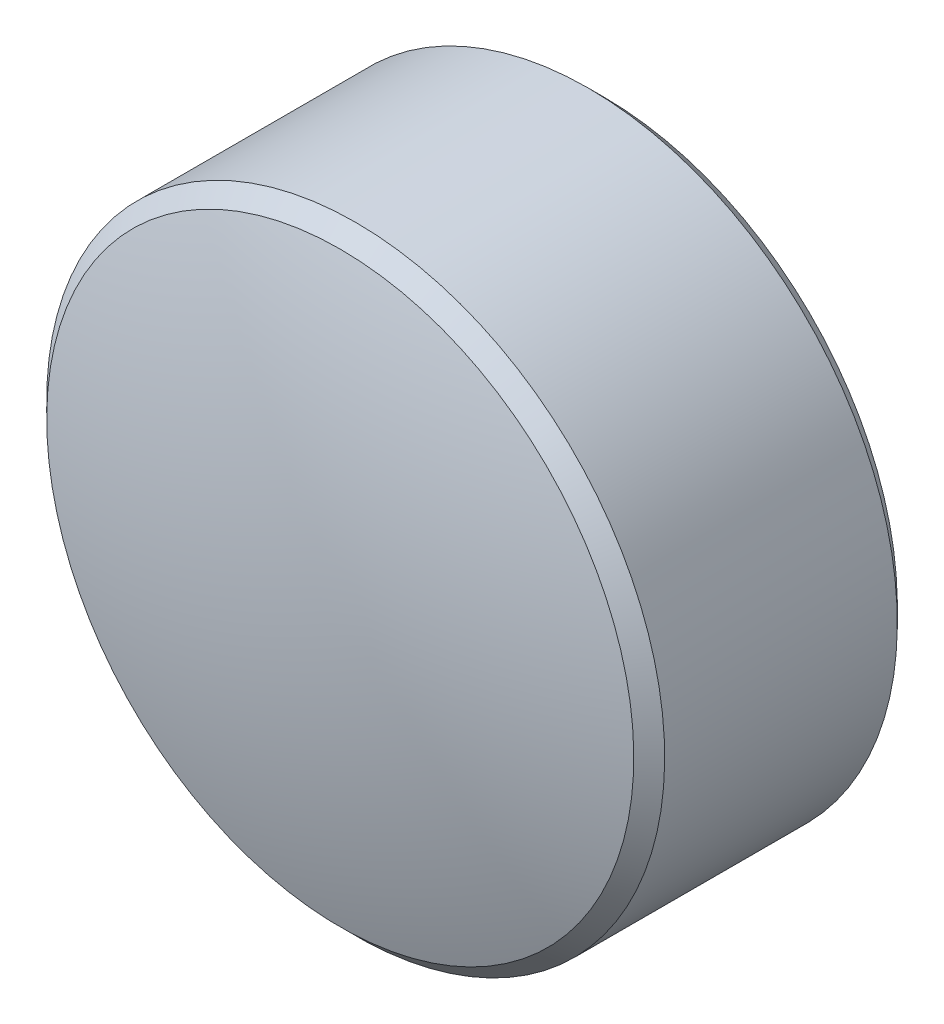
ISO-10303-21;
HEADER;
FILE_DESCRIPTION(('STEP AP214'),'2;1');
FILE_NAME('part.step','',(''),(''),'','','');
FILE_SCHEMA(('AUTOMOTIVE_DESIGN { 1 0 10303 214 1 1 1 1 }'));
ENDSEC;
DATA;
#1=APPLICATION_CONTEXT('core data for automotive mechanical design processes');
#2=APPLICATION_PROTOCOL_DEFINITION('international standard','automotive_design',2000,#1);
#3=PRODUCT_CONTEXT('',#1,'mechanical');
#4=PRODUCT('Part','Part','',(#3));
#5=PRODUCT_RELATED_PRODUCT_CATEGORY('part','',(#4));
#6=PRODUCT_DEFINITION_FORMATION('','',#4);
#7=PRODUCT_DEFINITION_CONTEXT('part definition',#1,'design');
#8=PRODUCT_DEFINITION('design','',#6,#7);
#9=PRODUCT_DEFINITION_SHAPE('','',#8);
#10=(LENGTH_UNIT() NAMED_UNIT(*) SI_UNIT(.MILLI.,.METRE.));
#11=(NAMED_UNIT(*) PLANE_ANGLE_UNIT() SI_UNIT($,.RADIAN.));
#12=(NAMED_UNIT(*) SI_UNIT($,.STERADIAN.) SOLID_ANGLE_UNIT());
#13=UNCERTAINTY_MEASURE_WITH_UNIT(LENGTH_MEASURE(1.E-05),#10,'distance_accuracy_value','');
#14=(GEOMETRIC_REPRESENTATION_CONTEXT(3) GLOBAL_UNCERTAINTY_ASSIGNED_CONTEXT((#13)) GLOBAL_UNIT_ASSIGNED_CONTEXT((#10,
#11,#12)) REPRESENTATION_CONTEXT('',''));
#15=CARTESIAN_POINT('',(0.,0.,0.));
#16=DIRECTION('',(0.,0.,1.));
#17=DIRECTION('',(1.,0.,0.));
#18=AXIS2_PLACEMENT_3D('',#15,#16,#17);
#19=CARTESIAN_POINT('',(0.882375412865104,0.994963829472796,0.996613018689777));
#20=DIRECTION('',(0.,0.,-1.));
#21=DIRECTION('',(0.,1.,0.));
#22=AXIS2_PLACEMENT_3D('',#19,#20,#21);
#23=PLANE('',#22);
#24=CARTESIAN_POINT('',(0.882375412865104,0.994963829472796,0.996613018689777));
#25=DIRECTION('',(0.,0.,-1.));
#26=DIRECTION('',(0.,1.,0.));
#27=AXIS2_PLACEMENT_3D('',#24,#25,#26);
#28=CIRCLE('',#27,0.95);
#29=CARTESIAN_POINT('',(0.882375412865104,1.9449638294728,0.996613018689777));
#30=VERTEX_POINT('',#29);
#31=EDGE_CURVE('E20',#30,#30,#28,.T.);
#32=ORIENTED_EDGE('',*,*,#31,.T.);
#33=EDGE_LOOP('',(#32));
#34=FACE_BOUND('',#33,.T.);
#35=ADVANCED_FACE('F13',(#34),#23,.T.);
#36=CARTESIAN_POINT('',(0.882375412865104,0.994963829472796,0.996613018689777));
#37=DIRECTION('',(0.,0.,-1.));
#38=DIRECTION('',(0.,1.,0.));
#39=AXIS2_PLACEMENT_3D('',#36,#37,#38);
#40=CYLINDRICAL_SURFACE('',#39,1.);
#41=CARTESIAN_POINT('',(0.882375412865104,0.994963829472796,1.04661301868978));
#42=DIRECTION('',(0.,0.,-1.));
#43=DIRECTION('',(0.,1.,0.));
#44=AXIS2_PLACEMENT_3D('',#41,#42,#43);
#45=CIRCLE('',#44,1.);
#46=CARTESIAN_POINT('',(0.882375412865104,1.9949638294728,1.04661301868978));
#47=VERTEX_POINT('',#46);
#48=EDGE_CURVE('E9',#47,#47,#45,.F.);
#49=ORIENTED_EDGE('',*,*,#48,.T.);
#50=EDGE_LOOP('',(#49));
#51=FACE_BOUND('',#50,.T.);
#52=CARTESIAN_POINT('',(0.882375412865104,0.994963829472796,1.79940529089051));
#53=DIRECTION('',(0.,0.,-1.));
#54=DIRECTION('',(0.,1.,0.));
#55=AXIS2_PLACEMENT_3D('',#52,#53,#54);
#56=CIRCLE('',#55,1.);
#57=CARTESIAN_POINT('',(0.882375412865104,1.9949638294728,1.79940529089051));
#58=VERTEX_POINT('',#57);
#59=EDGE_CURVE('E24',#58,#58,#56,.T.);
#60=ORIENTED_EDGE('',*,*,#59,.T.);
#61=EDGE_LOOP('',(#60));
#62=FACE_BOUND('',#61,.T.);
#63=ADVANCED_FACE('F46',(#51,#62),#40,.T.);
#64=CARTESIAN_POINT('',(0.882375412865104,0.994963829472796,1.79940529089051));
#65=DIRECTION('',(0.,0.,-1.));
#66=DIRECTION('',(0.,1.,0.));
#67=AXIS2_PLACEMENT_3D('',#64,#65,#66);
#68=CONICAL_SURFACE('',#67,1.,0.785398163397446);
#69=CARTESIAN_POINT('',(0.882375412865104,0.994963829472796,1.84940529089051));
#70=DIRECTION('',(0.,0.,-1.));
#71=DIRECTION('',(0.,1.,0.));
#72=AXIS2_PLACEMENT_3D('',#69,#70,#71);
#73=CIRCLE('',#72,0.95);
#74=CARTESIAN_POINT('',(0.882375412865104,1.9449638294728,1.84940529089051));
#75=VERTEX_POINT('',#74);
#76=EDGE_CURVE('E28',#75,#75,#73,.T.);
#77=ORIENTED_EDGE('',*,*,#76,.T.);
#78=EDGE_LOOP('',(#77));
#79=FACE_BOUND('',#78,.T.);
#80=ORIENTED_EDGE('',*,*,#59,.F.);
#81=EDGE_LOOP('',(#80));
#82=FACE_BOUND('',#81,.T.);
#83=ADVANCED_FACE('F34',(#79,#82),#68,.T.);
#84=CARTESIAN_POINT('',(0.882375412865104,0.994963829472795,-1.14238698131022));
#85=DIRECTION('',(0.,0.,-1.));
#86=DIRECTION('',(0.,1.,0.));
#87=AXIS2_PLACEMENT_3D('',#84,#85,#86);
#88=SPHERICAL_SURFACE('',#87,3.139);
#89=ORIENTED_EDGE('',*,*,#76,.F.);
#90=EDGE_LOOP('',(#89));
#91=FACE_BOUND('',#90,.T.);
#92=ADVANCED_FACE('F37',(#91),#88,.T.);
#93=CARTESIAN_POINT('',(0.882375412865104,0.994963829472796,0.996613018689777));
#94=DIRECTION('',(0.,0.,1.));
#95=DIRECTION('',(0.,-1.,0.));
#96=AXIS2_PLACEMENT_3D('',#93,#94,#95);
#97=CONICAL_SURFACE('',#96,0.95,0.785398163397448);
#98=ORIENTED_EDGE('',*,*,#48,.F.);
#99=EDGE_LOOP('',(#98));
#100=FACE_BOUND('',#99,.T.);
#101=ORIENTED_EDGE('',*,*,#31,.F.);
#102=EDGE_LOOP('',(#101));
#103=FACE_BOUND('',#102,.T.);
#104=ADVANCED_FACE('F15',(#100,#103),#97,.T.);
#105=CLOSED_SHELL('',(#35,#63,#83,#92,#104));
#106=MANIFOLD_SOLID_BREP('B1',#105);
#107=ADVANCED_BREP_SHAPE_REPRESENTATION('',(#18,#106),#14);
#108=SHAPE_DEFINITION_REPRESENTATION(#9,#107);
ENDSEC;
END-ISO-10303-21;
